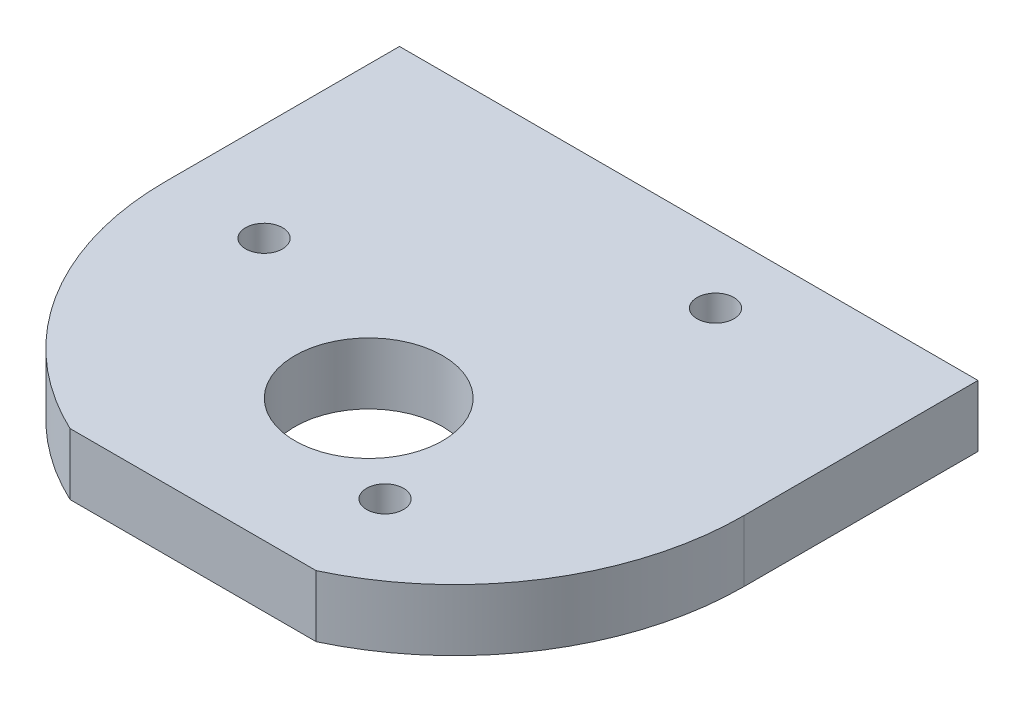
ISO-10303-21;
HEADER;
FILE_DESCRIPTION(('STEP AP214'),'2;1');
FILE_NAME('part.step','',(''),(''),'','','');
FILE_SCHEMA(('AUTOMOTIVE_DESIGN { 1 0 10303 214 1 1 1 1 }'));
ENDSEC;
DATA;
#1=APPLICATION_CONTEXT('core data for automotive mechanical design processes');
#2=APPLICATION_PROTOCOL_DEFINITION('international standard','automotive_design',2000,#1);
#3=PRODUCT_CONTEXT('',#1,'mechanical');
#4=PRODUCT('Part','Part','',(#3));
#5=PRODUCT_RELATED_PRODUCT_CATEGORY('part','',(#4));
#6=PRODUCT_DEFINITION_FORMATION('','',#4);
#7=PRODUCT_DEFINITION_CONTEXT('part definition',#1,'design');
#8=PRODUCT_DEFINITION('design','',#6,#7);
#9=PRODUCT_DEFINITION_SHAPE('','',#8);
#10=(LENGTH_UNIT() NAMED_UNIT(*) SI_UNIT(.MILLI.,.METRE.));
#11=(NAMED_UNIT(*) PLANE_ANGLE_UNIT() SI_UNIT($,.RADIAN.));
#12=(NAMED_UNIT(*) SI_UNIT($,.STERADIAN.) SOLID_ANGLE_UNIT());
#13=UNCERTAINTY_MEASURE_WITH_UNIT(LENGTH_MEASURE(1.E-05),#10,'distance_accuracy_value','');
#14=(GEOMETRIC_REPRESENTATION_CONTEXT(3) GLOBAL_UNCERTAINTY_ASSIGNED_CONTEXT((#13)) GLOBAL_UNIT_ASSIGNED_CONTEXT((#10,
#11,#12)) REPRESENTATION_CONTEXT('',''));
#15=CARTESIAN_POINT('',(0.,0.,0.));
#16=DIRECTION('',(0.,0.,1.));
#17=DIRECTION('',(1.,0.,0.));
#18=AXIS2_PLACEMENT_3D('',#15,#16,#17);
#19=CARTESIAN_POINT('',(0.,2.5,19.));
#20=DIRECTION('',(0.,-1.,0.));
#21=DIRECTION('',(0.,0.,-1.));
#22=AXIS2_PLACEMENT_3D('',#19,#20,#21);
#23=CYLINDRICAL_SURFACE('',#22,23.5);
#24=DIRECTION('',(0.,1.,0.));
#25=VECTOR('',#24,1.);
#26=CARTESIAN_POINT('',(10.,-2.5,40.2661703181368));
#27=LINE('',#26,#25);
#28=CARTESIAN_POINT('',(10.,-2.5,40.2661703181368));
#29=VERTEX_POINT('',#28);
#30=CARTESIAN_POINT('',(10.,2.5,40.2661703181368));
#31=VERTEX_POINT('',#30);
#32=EDGE_CURVE('E118',#29,#31,#27,.T.);
#33=ORIENTED_EDGE('',*,*,#32,.F.);
#34=CARTESIAN_POINT('',(0.,-2.5,19.));
#35=DIRECTION('',(0.,-1.,0.));
#36=DIRECTION('',(0.,0.,-1.));
#37=AXIS2_PLACEMENT_3D('',#34,#35,#36);
#38=CIRCLE('',#37,23.5);
#39=CARTESIAN_POINT('',(23.5,-2.5,19.));
#40=VERTEX_POINT('',#39);
#41=EDGE_CURVE('E126',#40,#29,#38,.T.);
#42=ORIENTED_EDGE('',*,*,#41,.F.);
#43=DIRECTION('',(0.,-1.,0.));
#44=VECTOR('',#43,1.);
#45=CARTESIAN_POINT('',(23.5,2.5,19.));
#46=LINE('',#45,#44);
#47=CARTESIAN_POINT('',(23.5,2.5,19.));
#48=VERTEX_POINT('',#47);
#49=EDGE_CURVE('E140',#48,#40,#46,.T.);
#50=ORIENTED_EDGE('',*,*,#49,.F.);
#51=CARTESIAN_POINT('',(0.,2.5,19.));
#52=DIRECTION('',(0.,-1.,0.));
#53=DIRECTION('',(0.,0.,-1.));
#54=AXIS2_PLACEMENT_3D('',#51,#52,#53);
#55=CIRCLE('',#54,23.5);
#56=EDGE_CURVE('E128',#48,#31,#55,.T.);
#57=ORIENTED_EDGE('',*,*,#56,.T.);
#58=EDGE_LOOP('',(#33,#42,#50,#57));
#59=FACE_BOUND('',#58,.T.);
#60=ADVANCED_FACE('F48',(#59),#23,.T.);
#61=CARTESIAN_POINT('',(-23.5,2.5,19.));
#62=DIRECTION('',(1.,0.,0.));
#63=DIRECTION('',(0.,0.,-1.));
#64=AXIS2_PLACEMENT_3D('',#61,#62,#63);
#65=PLANE('',#64);
#66=DIRECTION('',(0.,-1.,0.));
#67=VECTOR('',#66,1.);
#68=CARTESIAN_POINT('',(-23.5,2.5,0.));
#69=LINE('',#68,#67);
#70=CARTESIAN_POINT('',(-23.5,2.5,0.));
#71=VERTEX_POINT('',#70);
#72=CARTESIAN_POINT('',(-23.5,-2.5,0.));
#73=VERTEX_POINT('',#72);
#74=EDGE_CURVE('E143',#71,#73,#69,.T.);
#75=ORIENTED_EDGE('',*,*,#74,.T.);
#76=DIRECTION('',(0.,0.,-1.));
#77=VECTOR('',#76,1.);
#78=CARTESIAN_POINT('',(-23.5,-2.5,19.));
#79=LINE('',#78,#77);
#80=CARTESIAN_POINT('',(-23.5,-2.5,19.));
#81=VERTEX_POINT('',#80);
#82=EDGE_CURVE('E13',#81,#73,#79,.T.);
#83=ORIENTED_EDGE('',*,*,#82,.F.);
#84=DIRECTION('',(0.,-1.,0.));
#85=VECTOR('',#84,1.);
#86=CARTESIAN_POINT('',(-23.5,2.5,19.));
#87=LINE('',#86,#85);
#88=CARTESIAN_POINT('',(-23.5,2.5,19.));
#89=VERTEX_POINT('',#88);
#90=EDGE_CURVE('E138',#89,#81,#87,.T.);
#91=ORIENTED_EDGE('',*,*,#90,.F.);
#92=DIRECTION('',(0.,0.,-1.));
#93=VECTOR('',#92,1.);
#94=CARTESIAN_POINT('',(-23.5,2.5,19.));
#95=LINE('',#94,#93);
#96=EDGE_CURVE('E92',#89,#71,#95,.T.);
#97=ORIENTED_EDGE('',*,*,#96,.T.);
#98=EDGE_LOOP('',(#75,#83,#91,#97));
#99=FACE_BOUND('',#98,.T.);
#100=ADVANCED_FACE('F50',(#99),#65,.F.);
#101=CARTESIAN_POINT('',(-23.5,-2.5,19.));
#102=DIRECTION('',(0.,1.,0.));
#103=DIRECTION('',(-1.,0.,0.));
#104=AXIS2_PLACEMENT_3D('',#101,#102,#103);
#105=PLANE('',#104);
#106=CARTESIAN_POINT('',(7.74999999999997,-2.5,5.57660624134118));
#107=DIRECTION('',(0.,-1.,0.));
#108=DIRECTION('',(0.,0.,-1.));
#109=AXIS2_PLACEMENT_3D('',#106,#107,#108);
#110=CIRCLE('',#109,1.5);
#111=CARTESIAN_POINT('',(7.74999999999997,-2.5,4.07660624134118));
#112=VERTEX_POINT('',#111);
#113=EDGE_CURVE('E180',#112,#112,#110,.T.);
#114=ORIENTED_EDGE('',*,*,#113,.F.);
#115=EDGE_LOOP('',(#114));
#116=FACE_BOUND('',#115,.T.);
#117=CARTESIAN_POINT('',(-15.5,-2.5,19.));
#118=DIRECTION('',(0.,-1.,0.));
#119=DIRECTION('',(0.,0.,-1.));
#120=AXIS2_PLACEMENT_3D('',#117,#118,#119);
#121=CIRCLE('',#120,1.5);
#122=CARTESIAN_POINT('',(-15.5,-2.5,17.5));
#123=VERTEX_POINT('',#122);
#124=EDGE_CURVE('E186',#123,#123,#121,.T.);
#125=ORIENTED_EDGE('',*,*,#124,.F.);
#126=EDGE_LOOP('',(#125));
#127=FACE_BOUND('',#126,.T.);
#128=CARTESIAN_POINT('',(7.74999999999997,-2.5,32.4233937586588));
#129=DIRECTION('',(0.,-1.,0.));
#130=DIRECTION('',(0.,0.,-1.));
#131=AXIS2_PLACEMENT_3D('',#128,#129,#130);
#132=CIRCLE('',#131,1.5);
#133=CARTESIAN_POINT('',(7.74999999999997,-2.5,30.9233937586588));
#134=VERTEX_POINT('',#133);
#135=EDGE_CURVE('E192',#134,#134,#132,.T.);
#136=ORIENTED_EDGE('',*,*,#135,.F.);
#137=EDGE_LOOP('',(#136));
#138=FACE_BOUND('',#137,.T.);
#139=CARTESIAN_POINT('',(0.,-2.5,26.));
#140=DIRECTION('',(0.,-1.,0.));
#141=DIRECTION('',(0.,0.,-1.));
#142=AXIS2_PLACEMENT_3D('',#139,#140,#141);
#143=CIRCLE('',#142,6.);
#144=CARTESIAN_POINT('',(0.,-2.5,20.));
#145=VERTEX_POINT('',#144);
#146=EDGE_CURVE('E195',#145,#145,#143,.T.);
#147=ORIENTED_EDGE('',*,*,#146,.F.);
#148=EDGE_LOOP('',(#147));
#149=FACE_BOUND('',#148,.T.);
#150=ORIENTED_EDGE('',*,*,#41,.T.);
#151=DIRECTION('',(-1.,0.,0.));
#152=VECTOR('',#151,1.);
#153=CARTESIAN_POINT('',(-10.,-2.5,40.2661703181367));
#154=LINE('',#153,#152);
#155=CARTESIAN_POINT('',(-10.,-2.5,40.2661703181367));
#156=VERTEX_POINT('',#155);
#157=EDGE_CURVE('E115',#29,#156,#154,.T.);
#158=ORIENTED_EDGE('',*,*,#157,.T.);
#159=EDGE_CURVE('E98',#156,#81,#38,.T.);
#160=ORIENTED_EDGE('',*,*,#159,.T.);
#161=ORIENTED_EDGE('',*,*,#82,.T.);
#162=DIRECTION('',(1.,0.,0.));
#163=VECTOR('',#162,1.);
#164=CARTESIAN_POINT('',(-23.5,-2.5,0.));
#165=LINE('',#164,#163);
#166=CARTESIAN_POINT('',(23.5,-2.5,0.));
#167=VERTEX_POINT('',#166);
#168=EDGE_CURVE('E145',#73,#167,#165,.T.);
#169=ORIENTED_EDGE('',*,*,#168,.T.);
#170=DIRECTION('',(0.,0.,-1.));
#171=VECTOR('',#170,1.);
#172=CARTESIAN_POINT('',(23.5,-2.5,19.));
#173=LINE('',#172,#171);
#174=EDGE_CURVE('E56',#40,#167,#173,.T.);
#175=ORIENTED_EDGE('',*,*,#174,.F.);
#176=EDGE_LOOP('',(#150,#158,#160,#161,#169,#175));
#177=FACE_BOUND('',#176,.T.);
#178=ADVANCED_FACE('F131',(#116,#127,#138,#149,#177),#105,.F.);
#179=CARTESIAN_POINT('',(23.5,2.5,19.));
#180=DIRECTION('',(1.,0.,0.));
#181=DIRECTION('',(0.,0.,-1.));
#182=AXIS2_PLACEMENT_3D('',#179,#180,#181);
#183=PLANE('',#182);
#184=DIRECTION('',(0.,-1.,0.));
#185=VECTOR('',#184,1.);
#186=CARTESIAN_POINT('',(23.5,2.5,0.));
#187=LINE('',#186,#185);
#188=CARTESIAN_POINT('',(23.5,2.5,0.));
#189=VERTEX_POINT('',#188);
#190=EDGE_CURVE('E147',#189,#167,#187,.T.);
#191=ORIENTED_EDGE('',*,*,#190,.F.);
#192=DIRECTION('',(0.,0.,-1.));
#193=VECTOR('',#192,1.);
#194=CARTESIAN_POINT('',(23.5,2.5,19.));
#195=LINE('',#194,#193);
#196=EDGE_CURVE('E152',#48,#189,#195,.T.);
#197=ORIENTED_EDGE('',*,*,#196,.F.);
#198=ORIENTED_EDGE('',*,*,#49,.T.);
#199=ORIENTED_EDGE('',*,*,#174,.T.);
#200=EDGE_LOOP('',(#191,#197,#198,#199));
#201=FACE_BOUND('',#200,.T.);
#202=ADVANCED_FACE('F156',(#201),#183,.T.);
#203=CARTESIAN_POINT('',(-23.5,2.5,19.));
#204=DIRECTION('',(0.,1.,0.));
#205=DIRECTION('',(0.,0.,1.));
#206=AXIS2_PLACEMENT_3D('',#203,#204,#205);
#207=PLANE('',#206);
#208=DIRECTION('',(-1.,0.,0.));
#209=VECTOR('',#208,1.);
#210=CARTESIAN_POINT('',(-10.,2.5,40.2661703181367));
#211=LINE('',#210,#209);
#212=CARTESIAN_POINT('',(-10.,2.5,40.2661703181367));
#213=VERTEX_POINT('',#212);
#214=EDGE_CURVE('E63',#31,#213,#211,.T.);
#215=ORIENTED_EDGE('',*,*,#214,.F.);
#216=ORIENTED_EDGE('',*,*,#56,.F.);
#217=ORIENTED_EDGE('',*,*,#196,.T.);
#218=DIRECTION('',(1.,0.,0.));
#219=VECTOR('',#218,1.);
#220=CARTESIAN_POINT('',(-23.5,2.5,0.));
#221=LINE('',#220,#219);
#222=EDGE_CURVE('E141',#71,#189,#221,.T.);
#223=ORIENTED_EDGE('',*,*,#222,.F.);
#224=ORIENTED_EDGE('',*,*,#96,.F.);
#225=EDGE_CURVE('E71',#213,#89,#55,.T.);
#226=ORIENTED_EDGE('',*,*,#225,.F.);
#227=EDGE_LOOP('',(#215,#216,#217,#223,#224,#226));
#228=FACE_BOUND('',#227,.T.);
#229=CARTESIAN_POINT('',(7.74999999999997,2.5,5.57660624134118));
#230=DIRECTION('',(0.,-1.,0.));
#231=DIRECTION('',(0.,0.,-1.));
#232=AXIS2_PLACEMENT_3D('',#229,#230,#231);
#233=CIRCLE('',#232,1.5);
#234=CARTESIAN_POINT('',(7.74999999999997,2.5,4.07660624134118));
#235=VERTEX_POINT('',#234);
#236=EDGE_CURVE('E179',#235,#235,#233,.T.);
#237=ORIENTED_EDGE('',*,*,#236,.T.);
#238=EDGE_LOOP('',(#237));
#239=FACE_BOUND('',#238,.T.);
#240=CARTESIAN_POINT('',(-15.5,2.5,19.));
#241=DIRECTION('',(0.,-1.,0.));
#242=DIRECTION('',(0.,0.,-1.));
#243=AXIS2_PLACEMENT_3D('',#240,#241,#242);
#244=CIRCLE('',#243,1.5);
#245=CARTESIAN_POINT('',(-15.5,2.5,17.5));
#246=VERTEX_POINT('',#245);
#247=EDGE_CURVE('E183',#246,#246,#244,.T.);
#248=ORIENTED_EDGE('',*,*,#247,.T.);
#249=EDGE_LOOP('',(#248));
#250=FACE_BOUND('',#249,.T.);
#251=CARTESIAN_POINT('',(7.74999999999997,2.5,32.4233937586588));
#252=DIRECTION('',(0.,-1.,0.));
#253=DIRECTION('',(0.,0.,-1.));
#254=AXIS2_PLACEMENT_3D('',#251,#252,#253);
#255=CIRCLE('',#254,1.5);
#256=CARTESIAN_POINT('',(7.74999999999997,2.5,30.9233937586588));
#257=VERTEX_POINT('',#256);
#258=EDGE_CURVE('E189',#257,#257,#255,.T.);
#259=ORIENTED_EDGE('',*,*,#258,.T.);
#260=EDGE_LOOP('',(#259));
#261=FACE_BOUND('',#260,.T.);
#262=CARTESIAN_POINT('',(0.,2.5,26.));
#263=DIRECTION('',(0.,-1.,0.));
#264=DIRECTION('',(0.,0.,-1.));
#265=AXIS2_PLACEMENT_3D('',#262,#263,#264);
#266=CIRCLE('',#265,6.);
#267=CARTESIAN_POINT('',(0.,2.5,20.));
#268=VERTEX_POINT('',#267);
#269=EDGE_CURVE('E135',#268,#268,#266,.T.);
#270=ORIENTED_EDGE('',*,*,#269,.T.);
#271=EDGE_LOOP('',(#270));
#272=FACE_BOUND('',#271,.T.);
#273=ADVANCED_FACE('F162',(#228,#239,#250,#261,#272),#207,.T.);
#274=CARTESIAN_POINT('',(0.,0.,0.));
#275=DIRECTION('',(0.,0.,1.));
#276=DIRECTION('',(1.,0.,0.));
#277=AXIS2_PLACEMENT_3D('',#274,#275,#276);
#278=PLANE('',#277);
#279=CARTESIAN_POINT('',(18.,0.,0.));
#280=DIRECTION('',(0.,0.,-1.));
#281=DIRECTION('',(-1.,0.,0.));
#282=AXIS2_PLACEMENT_3D('',#279,#280,#281);
#283=CIRCLE('',#282,1.025);
#284=CARTESIAN_POINT('',(16.975,0.,0.));
#285=VERTEX_POINT('',#284);
#286=EDGE_CURVE('E173',#285,#285,#283,.T.);
#287=ORIENTED_EDGE('',*,*,#286,.F.);
#288=EDGE_LOOP('',(#287));
#289=FACE_BOUND('',#288,.T.);
#290=ORIENTED_EDGE('',*,*,#190,.T.);
#291=ORIENTED_EDGE('',*,*,#168,.F.);
#292=ORIENTED_EDGE('',*,*,#74,.F.);
#293=ORIENTED_EDGE('',*,*,#222,.T.);
#294=EDGE_LOOP('',(#290,#291,#292,#293));
#295=FACE_BOUND('',#294,.T.);
#296=CARTESIAN_POINT('',(-18.,0.,0.));
#297=DIRECTION('',(0.,0.,-1.));
#298=DIRECTION('',(-1.,0.,0.));
#299=AXIS2_PLACEMENT_3D('',#296,#297,#298);
#300=CIRCLE('',#299,1.025);
#301=CARTESIAN_POINT('',(-19.025,0.,0.));
#302=VERTEX_POINT('',#301);
#303=EDGE_CURVE('E166',#302,#302,#300,.T.);
#304=ORIENTED_EDGE('',*,*,#303,.F.);
#305=EDGE_LOOP('',(#304));
#306=FACE_BOUND('',#305,.T.);
#307=ADVANCED_FACE('F158',(#289,#295,#306),#278,.F.);
#308=DIRECTION('',(0.,1.,0.));
#309=VECTOR('',#308,1.);
#310=CARTESIAN_POINT('',(-10.,-2.5,40.2661703181367));
#311=LINE('',#310,#309);
#312=EDGE_CURVE('E119',#156,#213,#311,.T.);
#313=ORIENTED_EDGE('',*,*,#312,.T.);
#314=ORIENTED_EDGE('',*,*,#225,.T.);
#315=ORIENTED_EDGE('',*,*,#90,.T.);
#316=ORIENTED_EDGE('',*,*,#159,.F.);
#317=EDGE_LOOP('',(#313,#314,#315,#316));
#318=FACE_BOUND('',#317,.T.);
#319=ADVANCED_FACE('F215',(#318),#23,.T.);
#320=CARTESIAN_POINT('',(0.,2.5,26.));
#321=DIRECTION('',(0.,-1.,0.));
#322=DIRECTION('',(0.,0.,-1.));
#323=AXIS2_PLACEMENT_3D('',#320,#321,#322);
#324=CYLINDRICAL_SURFACE('',#323,6.);
#325=ORIENTED_EDGE('',*,*,#269,.F.);
#326=EDGE_LOOP('',(#325));
#327=FACE_BOUND('',#326,.T.);
#328=ORIENTED_EDGE('',*,*,#146,.T.);
#329=EDGE_LOOP('',(#328));
#330=FACE_BOUND('',#329,.T.);
#331=ADVANCED_FACE('F202',(#327,#330),#324,.F.);
#332=CARTESIAN_POINT('',(7.74999999999997,2.5,32.4233937586588));
#333=DIRECTION('',(0.,-1.,0.));
#334=DIRECTION('',(0.,0.,-1.));
#335=AXIS2_PLACEMENT_3D('',#332,#333,#334);
#336=CYLINDRICAL_SURFACE('',#335,1.5);
#337=ORIENTED_EDGE('',*,*,#258,.F.);
#338=EDGE_LOOP('',(#337));
#339=FACE_BOUND('',#338,.T.);
#340=ORIENTED_EDGE('',*,*,#135,.T.);
#341=EDGE_LOOP('',(#340));
#342=FACE_BOUND('',#341,.T.);
#343=ADVANCED_FACE('F225',(#339,#342),#336,.F.);
#344=CARTESIAN_POINT('',(-15.5,2.5,19.));
#345=DIRECTION('',(0.,-1.,0.));
#346=DIRECTION('',(0.,0.,-1.));
#347=AXIS2_PLACEMENT_3D('',#344,#345,#346);
#348=CYLINDRICAL_SURFACE('',#347,1.5);
#349=ORIENTED_EDGE('',*,*,#247,.F.);
#350=EDGE_LOOP('',(#349));
#351=FACE_BOUND('',#350,.T.);
#352=ORIENTED_EDGE('',*,*,#124,.T.);
#353=EDGE_LOOP('',(#352));
#354=FACE_BOUND('',#353,.T.);
#355=ADVANCED_FACE('F255',(#351,#354),#348,.F.);
#356=CARTESIAN_POINT('',(7.74999999999997,2.5,5.57660624134118));
#357=DIRECTION('',(0.,-1.,0.));
#358=DIRECTION('',(0.,0.,-1.));
#359=AXIS2_PLACEMENT_3D('',#356,#357,#358);
#360=CYLINDRICAL_SURFACE('',#359,1.5);
#361=ORIENTED_EDGE('',*,*,#236,.F.);
#362=EDGE_LOOP('',(#361));
#363=FACE_BOUND('',#362,.T.);
#364=ORIENTED_EDGE('',*,*,#113,.T.);
#365=EDGE_LOOP('',(#364));
#366=FACE_BOUND('',#365,.T.);
#367=ADVANCED_FACE('F247',(#363,#366),#360,.F.);
#368=CARTESIAN_POINT('',(18.,0.,7.25));
#369=DIRECTION('',(0.,0.,-1.));
#370=DIRECTION('',(-1.,0.,0.));
#371=AXIS2_PLACEMENT_3D('',#368,#369,#370);
#372=CONICAL_SURFACE('',#371,1.025,1.02974425867665);
#373=CARTESIAN_POINT('',(18.,0.,7.86588213450325));
#374=VERTEX_POINT('',#373);
#375=VERTEX_LOOP('',#374);
#376=FACE_BOUND('',#375,.T.);
#377=CARTESIAN_POINT('',(18.,0.,7.25));
#378=DIRECTION('',(0.,0.,-1.));
#379=DIRECTION('',(-1.,0.,0.));
#380=AXIS2_PLACEMENT_3D('',#377,#378,#379);
#381=CIRCLE('',#380,1.025);
#382=CARTESIAN_POINT('',(16.975,0.,7.25));
#383=VERTEX_POINT('',#382);
#384=EDGE_CURVE('E176',#383,#383,#381,.T.);
#385=ORIENTED_EDGE('',*,*,#384,.T.);
#386=EDGE_LOOP('',(#385));
#387=FACE_BOUND('',#386,.T.);
#388=ADVANCED_FACE('F237',(#376,#387),#372,.F.);
#389=CARTESIAN_POINT('',(18.,0.,0.));
#390=DIRECTION('',(0.,0.,-1.));
#391=DIRECTION('',(-1.,0.,0.));
#392=AXIS2_PLACEMENT_3D('',#389,#390,#391);
#393=CYLINDRICAL_SURFACE('',#392,1.025);
#394=ORIENTED_EDGE('',*,*,#384,.F.);
#395=EDGE_LOOP('',(#394));
#396=FACE_BOUND('',#395,.T.);
#397=ORIENTED_EDGE('',*,*,#286,.T.);
#398=EDGE_LOOP('',(#397));
#399=FACE_BOUND('',#398,.T.);
#400=ADVANCED_FACE('F234',(#396,#399),#393,.F.);
#401=CARTESIAN_POINT('',(-18.,0.,7.25));
#402=DIRECTION('',(0.,0.,-1.));
#403=DIRECTION('',(-1.,0.,0.));
#404=AXIS2_PLACEMENT_3D('',#401,#402,#403);
#405=CONICAL_SURFACE('',#404,1.025,1.02974425867665);
#406=CARTESIAN_POINT('',(-18.,0.,7.86588213450325));
#407=VERTEX_POINT('',#406);
#408=VERTEX_LOOP('',#407);
#409=FACE_BOUND('',#408,.T.);
#410=CARTESIAN_POINT('',(-18.,0.,7.25));
#411=DIRECTION('',(0.,0.,-1.));
#412=DIRECTION('',(-1.,0.,0.));
#413=AXIS2_PLACEMENT_3D('',#410,#411,#412);
#414=CIRCLE('',#413,1.025);
#415=CARTESIAN_POINT('',(-19.025,0.,7.25));
#416=VERTEX_POINT('',#415);
#417=EDGE_CURVE('E170',#416,#416,#414,.T.);
#418=ORIENTED_EDGE('',*,*,#417,.T.);
#419=EDGE_LOOP('',(#418));
#420=FACE_BOUND('',#419,.T.);
#421=ADVANCED_FACE('F236',(#409,#420),#405,.F.);
#422=CARTESIAN_POINT('',(-18.,0.,0.));
#423=DIRECTION('',(0.,0.,-1.));
#424=DIRECTION('',(-1.,0.,0.));
#425=AXIS2_PLACEMENT_3D('',#422,#423,#424);
#426=CYLINDRICAL_SURFACE('',#425,1.025);
#427=ORIENTED_EDGE('',*,*,#417,.F.);
#428=EDGE_LOOP('',(#427));
#429=FACE_BOUND('',#428,.T.);
#430=ORIENTED_EDGE('',*,*,#303,.T.);
#431=EDGE_LOOP('',(#430));
#432=FACE_BOUND('',#431,.T.);
#433=ADVANCED_FACE('F244',(#429,#432),#426,.F.);
#434=CARTESIAN_POINT('',(-10.,-2.5,40.2661703181367));
#435=DIRECTION('',(0.,0.,-1.));
#436=DIRECTION('',(-1.,0.,0.));
#437=AXIS2_PLACEMENT_3D('',#434,#435,#436);
#438=PLANE('',#437);
#439=ORIENTED_EDGE('',*,*,#214,.T.);
#440=ORIENTED_EDGE('',*,*,#312,.F.);
#441=ORIENTED_EDGE('',*,*,#157,.F.);
#442=ORIENTED_EDGE('',*,*,#32,.T.);
#443=EDGE_LOOP('',(#439,#440,#441,#442));
#444=FACE_BOUND('',#443,.T.);
#445=ADVANCED_FACE('F117',(#444),#438,.F.);
#446=CLOSED_SHELL('',(#60,#100,#178,#202,#273,#307,#319,#331,#343,#355,#367,#388,#400,#421,#433,#445));
#447=MANIFOLD_SOLID_BREP('B2',#446);
#448=ADVANCED_BREP_SHAPE_REPRESENTATION('',(#18,#447),#14);
#449=SHAPE_DEFINITION_REPRESENTATION(#9,#448);
ENDSEC;
END-ISO-10303-21;
